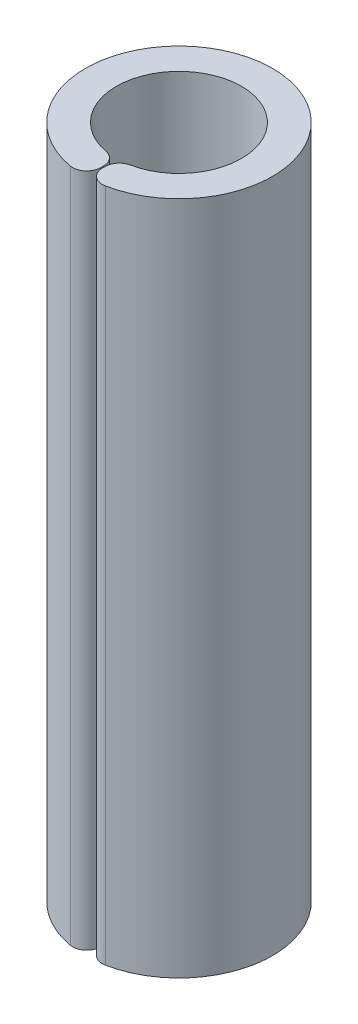
ISO-10303-21;
HEADER;
FILE_DESCRIPTION(('STEP AP214'),'2;1');
FILE_NAME('part.step','',(''),(''),'','','');
FILE_SCHEMA(('AUTOMOTIVE_DESIGN { 1 0 10303 214 1 1 1 1 }'));
ENDSEC;
DATA;
#1=APPLICATION_CONTEXT('core data for automotive mechanical design processes');
#2=APPLICATION_PROTOCOL_DEFINITION('international standard','automotive_design',2000,#1);
#3=PRODUCT_CONTEXT('',#1,'mechanical');
#4=PRODUCT('Part','Part','',(#3));
#5=PRODUCT_RELATED_PRODUCT_CATEGORY('part','',(#4));
#6=PRODUCT_DEFINITION_FORMATION('','',#4);
#7=PRODUCT_DEFINITION_CONTEXT('part definition',#1,'design');
#8=PRODUCT_DEFINITION('design','',#6,#7);
#9=PRODUCT_DEFINITION_SHAPE('','',#8);
#10=(LENGTH_UNIT() NAMED_UNIT(*) SI_UNIT(.MILLI.,.METRE.));
#11=(NAMED_UNIT(*) PLANE_ANGLE_UNIT() SI_UNIT($,.RADIAN.));
#12=(NAMED_UNIT(*) SI_UNIT($,.STERADIAN.) SOLID_ANGLE_UNIT());
#13=UNCERTAINTY_MEASURE_WITH_UNIT(LENGTH_MEASURE(1.E-05),#10,'distance_accuracy_value','');
#14=(GEOMETRIC_REPRESENTATION_CONTEXT(3) GLOBAL_UNCERTAINTY_ASSIGNED_CONTEXT((#13)) GLOBAL_UNIT_ASSIGNED_CONTEXT((#10,
#11,#12)) REPRESENTATION_CONTEXT('',''));
#15=CARTESIAN_POINT('',(0.,0.,0.));
#16=DIRECTION('',(0.,0.,1.));
#17=DIRECTION('',(1.,0.,0.));
#18=AXIS2_PLACEMENT_3D('',#15,#16,#17);
#19=CARTESIAN_POINT('',(0.,28.85,0.));
#20=DIRECTION('',(0.,-1.,0.));
#21=DIRECTION('',(0.,0.,-1.));
#22=AXIS2_PLACEMENT_3D('',#19,#20,#21);
#23=CYLINDRICAL_SURFACE('',#22,2.675);
#24=CARTESIAN_POINT('',(0.,0.,0.));
#25=DIRECTION('',(0.,-1.,0.));
#26=DIRECTION('',(0.,0.,1.));
#27=AXIS2_PLACEMENT_3D('',#24,#25,#26);
#28=CIRCLE('',#27,2.675);
#29=CARTESIAN_POINT('',(-0.490076335877862,0.,2.62972435532938));
#30=VERTEX_POINT('',#29);
#31=CARTESIAN_POINT('',(0.535896713145403,0.,2.62077082417367));
#32=VERTEX_POINT('',#31);
#33=EDGE_CURVE('E131',#30,#32,#28,.T.);
#34=ORIENTED_EDGE('',*,*,#33,.T.);
#35=DIRECTION('',(0.,-1.,0.));
#36=VECTOR('',#35,1.);
#37=CARTESIAN_POINT('',(0.535896713145403,28.85,2.62077082417367));
#38=LINE('',#37,#36);
#39=CARTESIAN_POINT('',(0.535896713145403,28.85,2.62077082417367));
#40=VERTEX_POINT('',#39);
#41=EDGE_CURVE('E11',#32,#40,#38,.F.);
#42=ORIENTED_EDGE('',*,*,#41,.T.);
#43=CARTESIAN_POINT('',(0.,28.85,0.));
#44=DIRECTION('',(0.,-1.,0.));
#45=DIRECTION('',(0.,0.,1.));
#46=AXIS2_PLACEMENT_3D('',#43,#44,#45);
#47=CIRCLE('',#46,2.675);
#48=CARTESIAN_POINT('',(-0.490076335877862,28.85,2.62972435532938));
#49=VERTEX_POINT('',#48);
#50=EDGE_CURVE('E129',#49,#40,#47,.T.);
#51=ORIENTED_EDGE('',*,*,#50,.F.);
#52=DIRECTION('',(0.,-1.,0.));
#53=VECTOR('',#52,1.);
#54=CARTESIAN_POINT('',(-0.490076335877863,28.85,2.62972435532938));
#55=LINE('',#54,#53);
#56=EDGE_CURVE('E43',#49,#30,#55,.T.);
#57=ORIENTED_EDGE('',*,*,#56,.T.);
#58=EDGE_LOOP('',(#34,#42,#51,#57));
#59=FACE_BOUND('',#58,.T.);
#60=ADVANCED_FACE('F35',(#59),#23,.F.);
#61=CARTESIAN_POINT('',(0.0466851872197338,28.85,2.67459258454335));
#62=DIRECTION('',(0.999847695156391,0.,-0.0174524064372837));
#63=DIRECTION('',(-0.0174524064372837,0.,-0.999847695156391));
#64=AXIS2_PLACEMENT_3D('',#61,#62,#63);
#65=PLANE('',#64);
#66=DIRECTION('',(0.0174524064372837,0.,0.999847695156391));
#67=VECTOR('',#66,1.);
#68=CARTESIAN_POINT('',(0.0466851872197338,0.,2.67459258454335));
#69=LINE('',#68,#67);
#70=CARTESIAN_POINT('',(0.0561892279720319,0.,3.21907871457967));
#71=VERTEX_POINT('',#70);
#72=CARTESIAN_POINT('',(0.0584069233316049,0.,3.34613039663832));
#73=VERTEX_POINT('',#72);
#74=EDGE_CURVE('E127',#71,#73,#69,.T.);
#75=ORIENTED_EDGE('',*,*,#74,.T.);
#76=DIRECTION('',(0.,-1.,0.));
#77=VECTOR('',#76,1.);
#78=CARTESIAN_POINT('',(0.058406923331605,28.85,3.34613039663832));
#79=LINE('',#78,#77);
#80=CARTESIAN_POINT('',(0.0584069233316049,28.85,3.34613039663832));
#81=VERTEX_POINT('',#80);
#82=EDGE_CURVE('E106',#73,#81,#79,.F.);
#83=ORIENTED_EDGE('',*,*,#82,.T.);
#84=DIRECTION('',(0.0174524064372837,0.,0.999847695156391));
#85=VECTOR('',#84,1.);
#86=CARTESIAN_POINT('',(0.0466851872197338,28.85,2.67459258454335));
#87=LINE('',#86,#85);
#88=CARTESIAN_POINT('',(0.0561892279720319,28.85,3.21907871457967));
#89=VERTEX_POINT('',#88);
#90=EDGE_CURVE('E167',#89,#81,#87,.T.);
#91=ORIENTED_EDGE('',*,*,#90,.F.);
#92=DIRECTION('',(0.,-1.,0.));
#93=VECTOR('',#92,1.);
#94=CARTESIAN_POINT('',(0.0561892279720319,28.85,3.21907871457967));
#95=LINE('',#94,#93);
#96=EDGE_CURVE('E111',#89,#71,#95,.T.);
#97=ORIENTED_EDGE('',*,*,#96,.T.);
#98=EDGE_LOOP('',(#75,#83,#91,#97));
#99=FACE_BOUND('',#98,.T.);
#100=ADVANCED_FACE('F177',(#99),#65,.F.);
#101=CARTESIAN_POINT('',(0.,28.85,0.));
#102=DIRECTION('',(0.,-1.,0.));
#103=DIRECTION('',(0.,0.,-1.));
#104=AXIS2_PLACEMENT_3D('',#101,#102,#103);
#105=CYLINDRICAL_SURFACE('',#104,4.);
#106=CARTESIAN_POINT('',(0.,28.85,0.));
#107=DIRECTION('',(0.,1.,0.));
#108=DIRECTION('',(0.,0.,1.));
#109=AXIS2_PLACEMENT_3D('',#106,#107,#108);
#110=CIRCLE('',#109,4.);
#111=CARTESIAN_POINT('',(0.774488871088752,28.85,3.92430465032465));
#112=VERTEX_POINT('',#111);
#113=CARTESIAN_POINT('',(-0.705882352941177,28.85,3.937223654278));
#114=VERTEX_POINT('',#113);
#115=EDGE_CURVE('E120',#112,#114,#110,.T.);
#116=ORIENTED_EDGE('',*,*,#115,.F.);
#117=DIRECTION('',(0.,-1.,0.));
#118=VECTOR('',#117,1.);
#119=CARTESIAN_POINT('',(0.774488871088752,28.85,3.92430465032465));
#120=LINE('',#119,#118);
#121=CARTESIAN_POINT('',(0.774488871088752,0.,3.92430465032465));
#122=VERTEX_POINT('',#121);
#123=EDGE_CURVE('E105',#112,#122,#120,.T.);
#124=ORIENTED_EDGE('',*,*,#123,.T.);
#125=CARTESIAN_POINT('',(0.,0.,0.));
#126=DIRECTION('',(0.,1.,0.));
#127=DIRECTION('',(0.,0.,1.));
#128=AXIS2_PLACEMENT_3D('',#125,#126,#127);
#129=CIRCLE('',#128,4.);
#130=CARTESIAN_POINT('',(-0.705882352941177,0.,3.937223654278));
#131=VERTEX_POINT('',#130);
#132=EDGE_CURVE('E118',#122,#131,#129,.T.);
#133=ORIENTED_EDGE('',*,*,#132,.T.);
#134=DIRECTION('',(0.,-1.,0.));
#135=VECTOR('',#134,1.);
#136=CARTESIAN_POINT('',(-0.705882352941177,28.85,3.937223654278));
#137=LINE('',#136,#135);
#138=EDGE_CURVE('E122',#131,#114,#137,.F.);
#139=ORIENTED_EDGE('',*,*,#138,.T.);
#140=EDGE_LOOP('',(#116,#124,#133,#139));
#141=FACE_BOUND('',#140,.T.);
#142=ADVANCED_FACE('F117',(#141),#105,.T.);
#143=CARTESIAN_POINT('',(0.,28.85,2.675));
#144=DIRECTION('',(-1.,0.,0.));
#145=DIRECTION('',(0.,0.,1.));
#146=AXIS2_PLACEMENT_3D('',#143,#144,#145);
#147=PLANE('',#146);
#148=DIRECTION('',(0.,0.,-1.));
#149=VECTOR('',#148,1.);
#150=CARTESIAN_POINT('',(0.,28.85,2.675));
#151=LINE('',#150,#149);
#152=CARTESIAN_POINT('',(0.,28.85,3.3466401061363));
#153=VERTEX_POINT('',#152);
#154=CARTESIAN_POINT('',(0.,28.85,3.21956907054345));
#155=VERTEX_POINT('',#154);
#156=EDGE_CURVE('E135',#153,#155,#151,.T.);
#157=ORIENTED_EDGE('',*,*,#156,.F.);
#158=DIRECTION('',(0.,-1.,0.));
#159=VECTOR('',#158,1.);
#160=CARTESIAN_POINT('',(0.,28.85,3.3466401061363));
#161=LINE('',#160,#159);
#162=CARTESIAN_POINT('',(0.,0.,3.3466401061363));
#163=VERTEX_POINT('',#162);
#164=EDGE_CURVE('E152',#153,#163,#161,.T.);
#165=ORIENTED_EDGE('',*,*,#164,.T.);
#166=DIRECTION('',(0.,0.,-1.));
#167=VECTOR('',#166,1.);
#168=CARTESIAN_POINT('',(0.,0.,2.675));
#169=LINE('',#168,#167);
#170=CARTESIAN_POINT('',(0.,0.,3.21956907054345));
#171=VERTEX_POINT('',#170);
#172=EDGE_CURVE('E126',#163,#171,#169,.T.);
#173=ORIENTED_EDGE('',*,*,#172,.T.);
#174=DIRECTION('',(0.,-1.,0.));
#175=VECTOR('',#174,1.);
#176=CARTESIAN_POINT('',(0.,28.85,3.21956907054345));
#177=LINE('',#176,#175);
#178=EDGE_CURVE('E50',#171,#155,#177,.F.);
#179=ORIENTED_EDGE('',*,*,#178,.T.);
#180=EDGE_LOOP('',(#157,#165,#173,#179));
#181=FACE_BOUND('',#180,.T.);
#182=ADVANCED_FACE('F181',(#181),#147,.F.);
#183=CARTESIAN_POINT('',(0.,28.85,0.));
#184=DIRECTION('',(0.,1.,0.));
#185=DIRECTION('',(0.,0.,1.));
#186=AXIS2_PLACEMENT_3D('',#183,#184,#185);
#187=PLANE('',#186);
#188=ORIENTED_EDGE('',*,*,#90,.T.);
#189=CARTESIAN_POINT('',(0.65831554042544,28.85,3.33565895277595));
#190=DIRECTION('',(0.,1.,0.));
#191=DIRECTION('',(0.,0.,1.));
#192=AXIS2_PLACEMENT_3D('',#189,#190,#191);
#193=CIRCLE('',#192,0.6);
#194=EDGE_CURVE('E149',#81,#112,#193,.T.);
#195=ORIENTED_EDGE('',*,*,#194,.T.);
#196=ORIENTED_EDGE('',*,*,#115,.T.);
#197=CARTESIAN_POINT('',(-0.6,28.85,3.3466401061363));
#198=DIRECTION('',(0.,1.,0.));
#199=DIRECTION('',(0.,0.,1.));
#200=AXIS2_PLACEMENT_3D('',#197,#198,#199);
#201=CIRCLE('',#200,0.6);
#202=EDGE_CURVE('E57',#114,#153,#201,.T.);
#203=ORIENTED_EDGE('',*,*,#202,.T.);
#204=ORIENTED_EDGE('',*,*,#156,.T.);
#205=CARTESIAN_POINT('',(-0.6,28.85,3.21956907054345));
#206=DIRECTION('',(0.,1.,0.));
#207=DIRECTION('',(0.,0.,1.));
#208=AXIS2_PLACEMENT_3D('',#205,#206,#207);
#209=CIRCLE('',#208,0.6);
#210=EDGE_CURVE('E144',#155,#49,#209,.T.);
#211=ORIENTED_EDGE('',*,*,#210,.T.);
#212=ORIENTED_EDGE('',*,*,#50,.T.);
#213=CARTESIAN_POINT('',(0.656097845065867,28.85,3.2086072707173));
#214=DIRECTION('',(0.,1.,0.));
#215=DIRECTION('',(0.,0.,1.));
#216=AXIS2_PLACEMENT_3D('',#213,#214,#215);
#217=CIRCLE('',#216,0.6);
#218=EDGE_CURVE('E146',#40,#89,#217,.T.);
#219=ORIENTED_EDGE('',*,*,#218,.T.);
#220=EDGE_LOOP('',(#188,#195,#196,#203,#204,#211,#212,#219));
#221=FACE_BOUND('',#220,.T.);
#222=ADVANCED_FACE('F171',(#221),#187,.T.);
#223=CARTESIAN_POINT('',(0.,0.,0.));
#224=DIRECTION('',(0.,1.,0.));
#225=DIRECTION('',(0.,0.,1.));
#226=AXIS2_PLACEMENT_3D('',#223,#224,#225);
#227=PLANE('',#226);
#228=ORIENTED_EDGE('',*,*,#132,.F.);
#229=CARTESIAN_POINT('',(0.65831554042544,0.,3.33565895277595));
#230=DIRECTION('',(0.,1.,0.));
#231=DIRECTION('',(0.,0.,1.));
#232=AXIS2_PLACEMENT_3D('',#229,#230,#231);
#233=CIRCLE('',#232,0.6);
#234=EDGE_CURVE('E101',#122,#73,#233,.F.);
#235=ORIENTED_EDGE('',*,*,#234,.T.);
#236=ORIENTED_EDGE('',*,*,#74,.F.);
#237=CARTESIAN_POINT('',(0.656097845065867,0.,3.2086072707173));
#238=DIRECTION('',(0.,1.,0.));
#239=DIRECTION('',(0.,0.,1.));
#240=AXIS2_PLACEMENT_3D('',#237,#238,#239);
#241=CIRCLE('',#240,0.6);
#242=EDGE_CURVE('E138',#71,#32,#241,.F.);
#243=ORIENTED_EDGE('',*,*,#242,.T.);
#244=ORIENTED_EDGE('',*,*,#33,.F.);
#245=CARTESIAN_POINT('',(-0.6,0.,3.21956907054345));
#246=DIRECTION('',(0.,1.,0.));
#247=DIRECTION('',(0.,0.,1.));
#248=AXIS2_PLACEMENT_3D('',#245,#246,#247);
#249=CIRCLE('',#248,0.6);
#250=EDGE_CURVE('E121',#30,#171,#249,.F.);
#251=ORIENTED_EDGE('',*,*,#250,.T.);
#252=ORIENTED_EDGE('',*,*,#172,.F.);
#253=CARTESIAN_POINT('',(-0.6,0.,3.3466401061363));
#254=DIRECTION('',(0.,1.,0.));
#255=DIRECTION('',(0.,0.,1.));
#256=AXIS2_PLACEMENT_3D('',#253,#254,#255);
#257=CIRCLE('',#256,0.6);
#258=EDGE_CURVE('E112',#163,#131,#257,.F.);
#259=ORIENTED_EDGE('',*,*,#258,.T.);
#260=EDGE_LOOP('',(#228,#235,#236,#243,#244,#251,#252,#259));
#261=FACE_BOUND('',#260,.T.);
#262=ADVANCED_FACE('F124',(#261),#227,.F.);
#263=CARTESIAN_POINT('',(0.65831554042544,28.85,3.33565895277595));
#264=DIRECTION('',(0.,-1.,0.));
#265=DIRECTION('',(0.,0.,-1.));
#266=AXIS2_PLACEMENT_3D('',#263,#264,#265);
#267=CYLINDRICAL_SURFACE('',#266,0.6);
#268=ORIENTED_EDGE('',*,*,#194,.F.);
#269=ORIENTED_EDGE('',*,*,#82,.F.);
#270=ORIENTED_EDGE('',*,*,#234,.F.);
#271=ORIENTED_EDGE('',*,*,#123,.F.);
#272=EDGE_LOOP('',(#268,#269,#270,#271));
#273=FACE_BOUND('',#272,.T.);
#274=ADVANCED_FACE('F104',(#273),#267,.T.);
#275=CARTESIAN_POINT('',(-0.6,28.85,3.3466401061363));
#276=DIRECTION('',(0.,-1.,0.));
#277=DIRECTION('',(0.,0.,-1.));
#278=AXIS2_PLACEMENT_3D('',#275,#276,#277);
#279=CYLINDRICAL_SURFACE('',#278,0.6);
#280=ORIENTED_EDGE('',*,*,#202,.F.);
#281=ORIENTED_EDGE('',*,*,#138,.F.);
#282=ORIENTED_EDGE('',*,*,#258,.F.);
#283=ORIENTED_EDGE('',*,*,#164,.F.);
#284=EDGE_LOOP('',(#280,#281,#282,#283));
#285=FACE_BOUND('',#284,.T.);
#286=ADVANCED_FACE('F180',(#285),#279,.T.);
#287=CARTESIAN_POINT('',(0.656097845065867,28.85,3.2086072707173));
#288=DIRECTION('',(0.,-1.,0.));
#289=DIRECTION('',(0.,0.,-1.));
#290=AXIS2_PLACEMENT_3D('',#287,#288,#289);
#291=CYLINDRICAL_SURFACE('',#290,0.6);
#292=ORIENTED_EDGE('',*,*,#218,.F.);
#293=ORIENTED_EDGE('',*,*,#41,.F.);
#294=ORIENTED_EDGE('',*,*,#242,.F.);
#295=ORIENTED_EDGE('',*,*,#96,.F.);
#296=EDGE_LOOP('',(#292,#293,#294,#295));
#297=FACE_BOUND('',#296,.T.);
#298=ADVANCED_FACE('F175',(#297),#291,.T.);
#299=CARTESIAN_POINT('',(-0.6,28.85,3.21956907054345));
#300=DIRECTION('',(0.,-1.,0.));
#301=DIRECTION('',(0.,0.,-1.));
#302=AXIS2_PLACEMENT_3D('',#299,#300,#301);
#303=CYLINDRICAL_SURFACE('',#302,0.6);
#304=ORIENTED_EDGE('',*,*,#210,.F.);
#305=ORIENTED_EDGE('',*,*,#178,.F.);
#306=ORIENTED_EDGE('',*,*,#250,.F.);
#307=ORIENTED_EDGE('',*,*,#56,.F.);
#308=EDGE_LOOP('',(#304,#305,#306,#307));
#309=FACE_BOUND('',#308,.T.);
#310=ADVANCED_FACE('F37',(#309),#303,.T.);
#311=CLOSED_SHELL('',(#60,#100,#142,#182,#222,#262,#274,#286,#298,#310));
#312=MANIFOLD_SOLID_BREP('B2',#311);
#313=ADVANCED_BREP_SHAPE_REPRESENTATION('',(#18,#312),#14);
#314=SHAPE_DEFINITION_REPRESENTATION(#9,#313);
ENDSEC;
END-ISO-10303-21;
